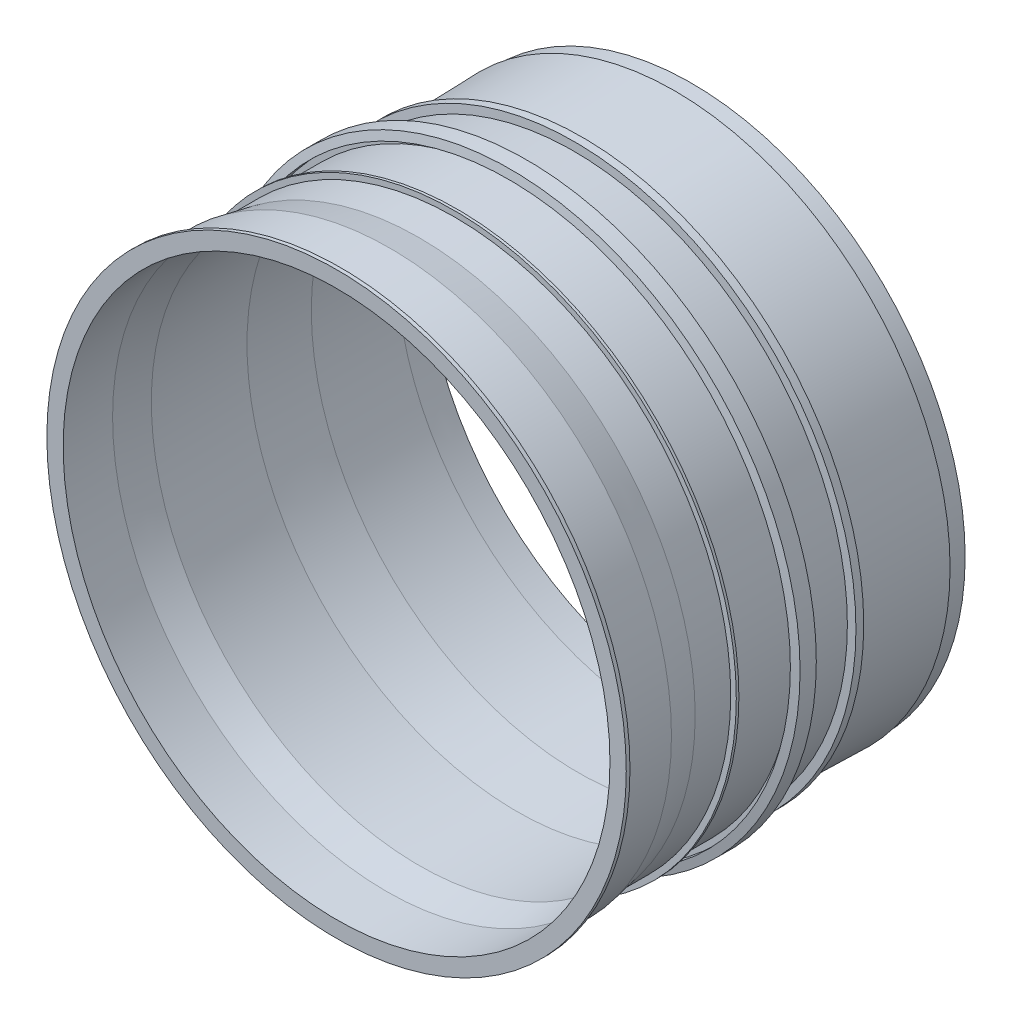
ISO-10303-21;
HEADER;
FILE_DESCRIPTION(('STEP AP214'),'2;1');
FILE_NAME('part.step','',(''),(''),'','','');
FILE_SCHEMA(('AUTOMOTIVE_DESIGN { 1 0 10303 214 1 1 1 1 }'));
ENDSEC;
DATA;
#1=APPLICATION_CONTEXT('core data for automotive mechanical design processes');
#2=APPLICATION_PROTOCOL_DEFINITION('international standard','automotive_design',2000,#1);
#3=PRODUCT_CONTEXT('',#1,'mechanical');
#4=PRODUCT('Part','Part','',(#3));
#5=PRODUCT_RELATED_PRODUCT_CATEGORY('part','',(#4));
#6=PRODUCT_DEFINITION_FORMATION('','',#4);
#7=PRODUCT_DEFINITION_CONTEXT('part definition',#1,'design');
#8=PRODUCT_DEFINITION('design','',#6,#7);
#9=PRODUCT_DEFINITION_SHAPE('','',#8);
#10=(LENGTH_UNIT() NAMED_UNIT(*) SI_UNIT(.MILLI.,.METRE.));
#11=(NAMED_UNIT(*) PLANE_ANGLE_UNIT() SI_UNIT($,.RADIAN.));
#12=(NAMED_UNIT(*) SI_UNIT($,.STERADIAN.) SOLID_ANGLE_UNIT());
#13=UNCERTAINTY_MEASURE_WITH_UNIT(LENGTH_MEASURE(1.E-05),#10,'distance_accuracy_value','');
#14=(GEOMETRIC_REPRESENTATION_CONTEXT(3) GLOBAL_UNCERTAINTY_ASSIGNED_CONTEXT((#13)) GLOBAL_UNIT_ASSIGNED_CONTEXT((#10,
#11,#12)) REPRESENTATION_CONTEXT('',''));
#15=CARTESIAN_POINT('',(0.,0.,0.));
#16=DIRECTION('',(0.,0.,1.));
#17=DIRECTION('',(1.,0.,0.));
#18=AXIS2_PLACEMENT_3D('',#15,#16,#17);
#19=CARTESIAN_POINT('',(0.,0.,-625.243112708749));
#20=DIRECTION('',(0.,0.,-1.));
#21=DIRECTION('',(-1.,0.,0.));
#22=AXIS2_PLACEMENT_3D('',#19,#20,#21);
#23=CONICAL_SURFACE('',#22,1107.27781024049,0.0123958644137673);
#24=CARTESIAN_POINT('',(0.,0.,-827.962379456543));
#25=DIRECTION('',(0.,0.,1.));
#26=DIRECTION('',(1.,0.,0.));
#27=AXIS2_PLACEMENT_3D('',#24,#25,#26);
#28=CIRCLE('',#27,1109.79081950068);
#29=CARTESIAN_POINT('',(1109.79081950068,0.,-827.962379456543));
#30=VERTEX_POINT('',#29);
#31=EDGE_CURVE('E132',#30,#30,#28,.T.);
#32=ORIENTED_EDGE('',*,*,#31,.F.);
#33=EDGE_LOOP('',(#32));
#34=FACE_BOUND('',#33,.T.);
#35=CARTESIAN_POINT('',(0.,0.,-625.243112708749));
#36=DIRECTION('',(0.,0.,1.));
#37=DIRECTION('',(1.,0.,0.));
#38=AXIS2_PLACEMENT_3D('',#35,#36,#37);
#39=CIRCLE('',#38,1107.27781024049);
#40=CARTESIAN_POINT('',(1107.27781024049,0.,-625.243112708749));
#41=VERTEX_POINT('',#40);
#42=EDGE_CURVE('E10',#41,#41,#39,.T.);
#43=ORIENTED_EDGE('',*,*,#42,.T.);
#44=EDGE_LOOP('',(#43));
#45=FACE_BOUND('',#44,.T.);
#46=ADVANCED_FACE('F35',(#34,#45),#23,.F.);
#47=CARTESIAN_POINT('',(0.,1107.27781024049,-625.243112708749));
#48=DIRECTION('',(0.,0.,-1.));
#49=DIRECTION('',(-1.,0.,0.));
#50=AXIS2_PLACEMENT_3D('',#47,#48,#49);
#51=PLANE('',#50);
#52=ORIENTED_EDGE('',*,*,#42,.F.);
#53=EDGE_LOOP('',(#52));
#54=FACE_BOUND('',#53,.T.);
#55=CARTESIAN_POINT('',(0.,0.,-625.243112708749));
#56=DIRECTION('',(0.,0.,1.));
#57=DIRECTION('',(1.,0.,0.));
#58=AXIS2_PLACEMENT_3D('',#55,#56,#57);
#59=CIRCLE('',#58,1173.29271015888);
#60=CARTESIAN_POINT('',(1173.29271015888,0.,-625.243112708749));
#61=VERTEX_POINT('',#60);
#62=EDGE_CURVE('E41',#61,#61,#59,.T.);
#63=ORIENTED_EDGE('',*,*,#62,.T.);
#64=EDGE_LOOP('',(#63));
#65=FACE_BOUND('',#64,.T.);
#66=ADVANCED_FACE('F139',(#54,#65),#51,.F.);
#67=CARTESIAN_POINT('',(0.,0.,0.));
#68=DIRECTION('',(0.,0.,1.));
#69=DIRECTION('',(1.,0.,0.));
#70=AXIS2_PLACEMENT_3D('',#67,#68,#69);
#71=CYLINDRICAL_SURFACE('',#70,1173.29271015888);
#72=ORIENTED_EDGE('',*,*,#62,.F.);
#73=EDGE_LOOP('',(#72));
#74=FACE_BOUND('',#73,.T.);
#75=CARTESIAN_POINT('',(0.,0.,-640.246499053838));
#76=DIRECTION('',(0.,0.,1.));
#77=DIRECTION('',(1.,0.,0.));
#78=AXIS2_PLACEMENT_3D('',#75,#76,#77);
#79=CIRCLE('',#78,1173.29271015888);
#80=CARTESIAN_POINT('',(1173.29271015888,0.,-640.246499053838));
#81=VERTEX_POINT('',#80);
#82=EDGE_CURVE('E45',#81,#81,#79,.T.);
#83=ORIENTED_EDGE('',*,*,#82,.T.);
#84=EDGE_LOOP('',(#83));
#85=FACE_BOUND('',#84,.T.);
#86=ADVANCED_FACE('F143',(#74,#85),#71,.T.);
#87=CARTESIAN_POINT('',(0.,1173.29271015888,-640.246499053838));
#88=DIRECTION('',(0.,0.,1.));
#89=DIRECTION('',(1.,0.,0.));
#90=AXIS2_PLACEMENT_3D('',#87,#88,#89);
#91=PLANE('',#90);
#92=ORIENTED_EDGE('',*,*,#82,.F.);
#93=EDGE_LOOP('',(#92));
#94=FACE_BOUND('',#93,.T.);
#95=CARTESIAN_POINT('',(0.,0.,-640.246499053838));
#96=DIRECTION('',(0.,0.,1.));
#97=DIRECTION('',(1.,0.,0.));
#98=AXIS2_PLACEMENT_3D('',#95,#96,#97);
#99=CIRCLE('',#98,1140.28526019969);
#100=CARTESIAN_POINT('',(1140.28526019969,0.,-640.246499053838));
#101=VERTEX_POINT('',#100);
#102=EDGE_CURVE('E49',#101,#101,#99,.T.);
#103=ORIENTED_EDGE('',*,*,#102,.T.);
#104=EDGE_LOOP('',(#103));
#105=FACE_BOUND('',#104,.T.);
#106=ADVANCED_FACE('F148',(#94,#105),#91,.F.);
#107=CARTESIAN_POINT('',(0.,0.,0.));
#108=DIRECTION('',(0.,0.,1.));
#109=DIRECTION('',(1.,0.,0.));
#110=AXIS2_PLACEMENT_3D('',#107,#108,#109);
#111=CYLINDRICAL_SURFACE('',#110,1140.28526019969);
#112=ORIENTED_EDGE('',*,*,#102,.F.);
#113=EDGE_LOOP('',(#112));
#114=FACE_BOUND('',#113,.T.);
#115=CARTESIAN_POINT('',(0.,0.,-841.291876078033));
#116=DIRECTION('',(0.,0.,1.));
#117=DIRECTION('',(1.,0.,0.));
#118=AXIS2_PLACEMENT_3D('',#115,#116,#117);
#119=CIRCLE('',#118,1140.28526019969);
#120=CARTESIAN_POINT('',(1140.28526019969,0.,-841.291876078033));
#121=VERTEX_POINT('',#120);
#122=EDGE_CURVE('E54',#121,#121,#119,.T.);
#123=ORIENTED_EDGE('',*,*,#122,.T.);
#124=EDGE_LOOP('',(#123));
#125=FACE_BOUND('',#124,.T.);
#126=ADVANCED_FACE('F154',(#114,#125),#111,.T.);
#127=CARTESIAN_POINT('',(0.,0.,-959.818628204238));
#128=DIRECTION('',(0.,0.,1.));
#129=DIRECTION('',(1.,0.,0.));
#130=AXIS2_PLACEMENT_3D('',#127,#128,#129);
#131=CONICAL_SURFACE('',#130,1117.78018068205,0.187639771804361);
#132=ORIENTED_EDGE('',*,*,#122,.F.);
#133=EDGE_LOOP('',(#132));
#134=FACE_BOUND('',#133,.T.);
#135=CARTESIAN_POINT('',(0.,0.,-959.818628204238));
#136=DIRECTION('',(0.,0.,1.));
#137=DIRECTION('',(1.,0.,0.));
#138=AXIS2_PLACEMENT_3D('',#135,#136,#137);
#139=CIRCLE('',#138,1117.78018068205);
#140=CARTESIAN_POINT('',(1117.78018068205,0.,-959.818628204238));
#141=VERTEX_POINT('',#140);
#142=EDGE_CURVE('E57',#141,#141,#139,.T.);
#143=ORIENTED_EDGE('',*,*,#142,.T.);
#144=EDGE_LOOP('',(#143));
#145=FACE_BOUND('',#144,.T.);
#146=ADVANCED_FACE('F158',(#134,#145),#131,.T.);
#147=CARTESIAN_POINT('',(0.,0.,0.));
#148=DIRECTION('',(0.,0.,1.));
#149=DIRECTION('',(1.,0.,0.));
#150=AXIS2_PLACEMENT_3D('',#147,#148,#149);
#151=CYLINDRICAL_SURFACE('',#150,1117.78018068205);
#152=ORIENTED_EDGE('',*,*,#142,.F.);
#153=EDGE_LOOP('',(#152));
#154=FACE_BOUND('',#153,.T.);
#155=CARTESIAN_POINT('',(0.,0.,-1103.85113711709));
#156=DIRECTION('',(0.,0.,1.));
#157=DIRECTION('',(1.,0.,0.));
#158=AXIS2_PLACEMENT_3D('',#155,#156,#157);
#159=CIRCLE('',#158,1117.78018068205);
#160=CARTESIAN_POINT('',(1117.78018068205,0.,-1103.85113711709));
#161=VERTEX_POINT('',#160);
#162=EDGE_CURVE('E60',#161,#161,#159,.T.);
#163=ORIENTED_EDGE('',*,*,#162,.T.);
#164=EDGE_LOOP('',(#163));
#165=FACE_BOUND('',#164,.T.);
#166=ADVANCED_FACE('F162',(#154,#165),#151,.T.);
#167=CARTESIAN_POINT('',(0.,1117.78018068205,-1103.85113711709));
#168=DIRECTION('',(0.,0.,-1.));
#169=DIRECTION('',(-1.,0.,0.));
#170=AXIS2_PLACEMENT_3D('',#167,#168,#169);
#171=PLANE('',#170);
#172=ORIENTED_EDGE('',*,*,#162,.F.);
#173=EDGE_LOOP('',(#172));
#174=FACE_BOUND('',#173,.T.);
#175=CARTESIAN_POINT('',(0.,0.,-1103.85113711709));
#176=DIRECTION('',(0.,0.,1.));
#177=DIRECTION('',(1.,0.,0.));
#178=AXIS2_PLACEMENT_3D('',#175,#176,#177);
#179=CIRCLE('',#178,1140.28526019969);
#180=CARTESIAN_POINT('',(1140.28526019969,0.,-1103.85113711709));
#181=VERTEX_POINT('',#180);
#182=EDGE_CURVE('E63',#181,#181,#179,.T.);
#183=ORIENTED_EDGE('',*,*,#182,.T.);
#184=EDGE_LOOP('',(#183));
#185=FACE_BOUND('',#184,.T.);
#186=ADVANCED_FACE('F166',(#174,#185),#171,.F.);
#187=CARTESIAN_POINT('',(0.,0.,0.));
#188=DIRECTION('',(0.,0.,1.));
#189=DIRECTION('',(1.,0.,0.));
#190=AXIS2_PLACEMENT_3D('',#187,#188,#189);
#191=CYLINDRICAL_SURFACE('',#190,1140.28526019969);
#192=ORIENTED_EDGE('',*,*,#182,.F.);
#193=EDGE_LOOP('',(#192));
#194=FACE_BOUND('',#193,.T.);
#195=CARTESIAN_POINT('',(0.,0.,-1114.35350755866));
#196=DIRECTION('',(0.,0.,1.));
#197=DIRECTION('',(1.,0.,0.));
#198=AXIS2_PLACEMENT_3D('',#195,#196,#197);
#199=CIRCLE('',#198,1140.28526019969);
#200=CARTESIAN_POINT('',(1140.28526019969,0.,-1114.35350755866));
#201=VERTEX_POINT('',#200);
#202=EDGE_CURVE('E66',#201,#201,#199,.T.);
#203=ORIENTED_EDGE('',*,*,#202,.T.);
#204=EDGE_LOOP('',(#203));
#205=FACE_BOUND('',#204,.T.);
#206=ADVANCED_FACE('F170',(#194,#205),#191,.T.);
#207=CARTESIAN_POINT('',(0.,1140.28526019969,-1114.35350755866));
#208=DIRECTION('',(0.,0.,1.));
#209=DIRECTION('',(1.,0.,0.));
#210=AXIS2_PLACEMENT_3D('',#207,#208,#209);
#211=PLANE('',#210);
#212=ORIENTED_EDGE('',*,*,#202,.F.);
#213=EDGE_LOOP('',(#212));
#214=FACE_BOUND('',#213,.T.);
#215=CARTESIAN_POINT('',(0.,0.,-1114.35350755866));
#216=DIRECTION('',(0.,0.,1.));
#217=DIRECTION('',(1.,0.,0.));
#218=AXIS2_PLACEMENT_3D('',#215,#216,#217);
#219=CIRCLE('',#218,1117.78018068205);
#220=CARTESIAN_POINT('',(1117.78018068205,0.,-1114.35350755866));
#221=VERTEX_POINT('',#220);
#222=EDGE_CURVE('E69',#221,#221,#219,.T.);
#223=ORIENTED_EDGE('',*,*,#222,.T.);
#224=EDGE_LOOP('',(#223));
#225=FACE_BOUND('',#224,.T.);
#226=ADVANCED_FACE('F174',(#214,#225),#211,.F.);
#227=CARTESIAN_POINT('',(0.,0.,0.));
#228=DIRECTION('',(0.,0.,1.));
#229=DIRECTION('',(1.,0.,0.));
#230=AXIS2_PLACEMENT_3D('',#227,#228,#229);
#231=CYLINDRICAL_SURFACE('',#230,1117.78018068205);
#232=ORIENTED_EDGE('',*,*,#222,.F.);
#233=EDGE_LOOP('',(#232));
#234=FACE_BOUND('',#233,.T.);
#235=CARTESIAN_POINT('',(0.,0.,-1355.90802771459));
#236=DIRECTION('',(0.,0.,1.));
#237=DIRECTION('',(1.,0.,0.));
#238=AXIS2_PLACEMENT_3D('',#235,#236,#237);
#239=CIRCLE('',#238,1117.78018068205);
#240=CARTESIAN_POINT('',(1117.78018068205,0.,-1355.90802771459));
#241=VERTEX_POINT('',#240);
#242=EDGE_CURVE('E72',#241,#241,#239,.T.);
#243=ORIENTED_EDGE('',*,*,#242,.T.);
#244=EDGE_LOOP('',(#243));
#245=FACE_BOUND('',#244,.T.);
#246=ADVANCED_FACE('F178',(#234,#245),#231,.T.);
#247=CARTESIAN_POINT('',(0.,1117.78018068205,-1355.90802771459));
#248=DIRECTION('',(0.,0.,-1.));
#249=DIRECTION('',(-1.,0.,0.));
#250=AXIS2_PLACEMENT_3D('',#247,#248,#249);
#251=PLANE('',#250);
#252=ORIENTED_EDGE('',*,*,#242,.F.);
#253=EDGE_LOOP('',(#252));
#254=FACE_BOUND('',#253,.T.);
#255=CARTESIAN_POINT('',(0.,0.,-1355.90802771459));
#256=DIRECTION('',(0.,0.,1.));
#257=DIRECTION('',(1.,0.,0.));
#258=AXIS2_PLACEMENT_3D('',#255,#256,#257);
#259=CIRCLE('',#258,1140.28526019969);
#260=CARTESIAN_POINT('',(1140.28526019969,0.,-1355.90802771459));
#261=VERTEX_POINT('',#260);
#262=EDGE_CURVE('E75',#261,#261,#259,.T.);
#263=ORIENTED_EDGE('',*,*,#262,.T.);
#264=EDGE_LOOP('',(#263));
#265=FACE_BOUND('',#264,.T.);
#266=ADVANCED_FACE('F182',(#254,#265),#251,.F.);
#267=CARTESIAN_POINT('',(0.,0.,0.));
#268=DIRECTION('',(0.,0.,1.));
#269=DIRECTION('',(1.,0.,0.));
#270=AXIS2_PLACEMENT_3D('',#267,#268,#269);
#271=CYLINDRICAL_SURFACE('',#270,1140.28526019969);
#272=ORIENTED_EDGE('',*,*,#262,.F.);
#273=EDGE_LOOP('',(#272));
#274=FACE_BOUND('',#273,.T.);
#275=CARTESIAN_POINT('',(0.,0.,-1322.9005777554));
#276=DIRECTION('',(0.,0.,1.));
#277=DIRECTION('',(1.,0.,0.));
#278=AXIS2_PLACEMENT_3D('',#275,#276,#277);
#279=CIRCLE('',#278,1140.28526019969);
#280=CARTESIAN_POINT('',(1140.28526019969,0.,-1322.9005777554));
#281=VERTEX_POINT('',#280);
#282=EDGE_CURVE('E78',#281,#281,#279,.T.);
#283=ORIENTED_EDGE('',*,*,#282,.T.);
#284=EDGE_LOOP('',(#283));
#285=FACE_BOUND('',#284,.T.);
#286=ADVANCED_FACE('F186',(#274,#285),#271,.F.);
#287=CARTESIAN_POINT('',(0.,0.,-1329.16781508942));
#288=DIRECTION('',(0.,0.,-1.));
#289=DIRECTION('',(-1.,0.,0.));
#290=AXIS2_PLACEMENT_3D('',#287,#288,#289);
#291=CONICAL_SURFACE('',#290,1173.29271015888,1.38315655499054);
#292=ORIENTED_EDGE('',*,*,#282,.F.);
#293=EDGE_LOOP('',(#292));
#294=FACE_BOUND('',#293,.T.);
#295=CARTESIAN_POINT('',(0.,0.,-1329.16781508942));
#296=DIRECTION('',(0.,0.,1.));
#297=DIRECTION('',(1.,0.,0.));
#298=AXIS2_PLACEMENT_3D('',#295,#296,#297);
#299=CIRCLE('',#298,1173.29271015888);
#300=CARTESIAN_POINT('',(1173.29271015888,0.,-1329.16781508942));
#301=VERTEX_POINT('',#300);
#302=EDGE_CURVE('E81',#301,#301,#299,.T.);
#303=ORIENTED_EDGE('',*,*,#302,.T.);
#304=EDGE_LOOP('',(#303));
#305=FACE_BOUND('',#304,.T.);
#306=ADVANCED_FACE('F190',(#294,#305),#291,.T.);
#307=CARTESIAN_POINT('',(0.,0.,0.));
#308=DIRECTION('',(0.,0.,1.));
#309=DIRECTION('',(1.,0.,0.));
#310=AXIS2_PLACEMENT_3D('',#307,#308,#309);
#311=CYLINDRICAL_SURFACE('',#310,1173.29271015888);
#312=ORIENTED_EDGE('',*,*,#302,.F.);
#313=EDGE_LOOP('',(#312));
#314=FACE_BOUND('',#313,.T.);
#315=CARTESIAN_POINT('',(0.,0.,-1394.91683221182));
#316=DIRECTION('',(0.,0.,1.));
#317=DIRECTION('',(1.,0.,0.));
#318=AXIS2_PLACEMENT_3D('',#315,#316,#317);
#319=CIRCLE('',#318,1173.29271015888);
#320=CARTESIAN_POINT('',(1173.29271015888,0.,-1394.91683221182));
#321=VERTEX_POINT('',#320);
#322=EDGE_CURVE('E84',#321,#321,#319,.T.);
#323=ORIENTED_EDGE('',*,*,#322,.T.);
#324=EDGE_LOOP('',(#323));
#325=FACE_BOUND('',#324,.T.);
#326=ADVANCED_FACE('F194',(#314,#325),#311,.T.);
#327=CARTESIAN_POINT('',(0.,0.,-1412.95381464829));
#328=DIRECTION('',(0.,0.,1.));
#329=DIRECTION('',(1.,0.,0.));
#330=AXIS2_PLACEMENT_3D('',#327,#328,#329);
#331=CONICAL_SURFACE('',#330,1140.28526019969,1.07068129613697);
#332=ORIENTED_EDGE('',*,*,#322,.F.);
#333=EDGE_LOOP('',(#332));
#334=FACE_BOUND('',#333,.T.);
#335=CARTESIAN_POINT('',(0.,0.,-1412.95381464829));
#336=DIRECTION('',(0.,0.,1.));
#337=DIRECTION('',(1.,0.,0.));
#338=AXIS2_PLACEMENT_3D('',#335,#336,#337);
#339=CIRCLE('',#338,1140.28526019969);
#340=CARTESIAN_POINT('',(1140.28526019969,0.,-1412.95381464829));
#341=VERTEX_POINT('',#340);
#342=EDGE_CURVE('E87',#341,#341,#339,.T.);
#343=ORIENTED_EDGE('',*,*,#342,.T.);
#344=EDGE_LOOP('',(#343));
#345=FACE_BOUND('',#344,.T.);
#346=ADVANCED_FACE('F198',(#334,#345),#331,.T.);
#347=CARTESIAN_POINT('',(0.,0.,0.));
#348=DIRECTION('',(0.,0.,1.));
#349=DIRECTION('',(1.,0.,0.));
#350=AXIS2_PLACEMENT_3D('',#347,#348,#349);
#351=CYLINDRICAL_SURFACE('',#350,1140.28526019969);
#352=ORIENTED_EDGE('',*,*,#342,.F.);
#353=EDGE_LOOP('',(#352));
#354=FACE_BOUND('',#353,.T.);
#355=CARTESIAN_POINT('',(0.,0.,-1373.73371524404));
#356=DIRECTION('',(0.,0.,1.));
#357=DIRECTION('',(1.,0.,0.));
#358=AXIS2_PLACEMENT_3D('',#355,#356,#357);
#359=CIRCLE('',#358,1140.28526019969);
#360=CARTESIAN_POINT('',(1140.28526019969,0.,-1373.73371524404));
#361=VERTEX_POINT('',#360);
#362=EDGE_CURVE('E90',#361,#361,#359,.T.);
#363=ORIENTED_EDGE('',*,*,#362,.T.);
#364=EDGE_LOOP('',(#363));
#365=FACE_BOUND('',#364,.T.);
#366=ADVANCED_FACE('F202',(#354,#365),#351,.F.);
#367=CARTESIAN_POINT('',(0.,1140.28526019969,-1373.73371524404));
#368=DIRECTION('',(0.,0.,1.));
#369=DIRECTION('',(1.,0.,0.));
#370=AXIS2_PLACEMENT_3D('',#367,#368,#369);
#371=PLANE('',#370);
#372=ORIENTED_EDGE('',*,*,#362,.F.);
#373=EDGE_LOOP('',(#372));
#374=FACE_BOUND('',#373,.T.);
#375=CARTESIAN_POINT('',(0.,0.,-1373.73371524404));
#376=DIRECTION('',(0.,0.,1.));
#377=DIRECTION('',(1.,0.,0.));
#378=AXIS2_PLACEMENT_3D('',#375,#376,#377);
#379=CIRCLE('',#378,1117.78018068205);
#380=CARTESIAN_POINT('',(1117.78018068205,0.,-1373.73371524404));
#381=VERTEX_POINT('',#380);
#382=EDGE_CURVE('E93',#381,#381,#379,.T.);
#383=ORIENTED_EDGE('',*,*,#382,.T.);
#384=EDGE_LOOP('',(#383));
#385=FACE_BOUND('',#384,.T.);
#386=ADVANCED_FACE('F206',(#374,#385),#371,.F.);
#387=CARTESIAN_POINT('',(0.,0.,-1586.79305110007));
#388=DIRECTION('',(0.,0.,1.));
#389=DIRECTION('',(1.,0.,0.));
#390=AXIS2_PLACEMENT_3D('',#387,#388,#389);
#391=CONICAL_SURFACE('',#390,1107.27781024049,0.0492533054253626);
#392=ORIENTED_EDGE('',*,*,#382,.F.);
#393=EDGE_LOOP('',(#392));
#394=FACE_BOUND('',#393,.T.);
#395=CARTESIAN_POINT('',(0.,0.,-1586.79305110007));
#396=DIRECTION('',(0.,0.,1.));
#397=DIRECTION('',(1.,0.,0.));
#398=AXIS2_PLACEMENT_3D('',#395,#396,#397);
#399=CIRCLE('',#398,1107.27781024049);
#400=CARTESIAN_POINT('',(1107.27781024049,0.,-1586.79305110007));
#401=VERTEX_POINT('',#400);
#402=EDGE_CURVE('E96',#401,#401,#399,.T.);
#403=ORIENTED_EDGE('',*,*,#402,.T.);
#404=EDGE_LOOP('',(#403));
#405=FACE_BOUND('',#404,.T.);
#406=ADVANCED_FACE('F210',(#394,#405),#391,.T.);
#407=CARTESIAN_POINT('',(0.,0.,-1588.4200930009));
#408=DIRECTION('',(0.,0.,-1.));
#409=DIRECTION('',(-1.,0.,0.));
#410=AXIS2_PLACEMENT_3D('',#407,#408,#409);
#411=CONICAL_SURFACE('',#410,1140.28526019969,1.52154302136954);
#412=ORIENTED_EDGE('',*,*,#402,.F.);
#413=EDGE_LOOP('',(#412));
#414=FACE_BOUND('',#413,.T.);
#415=CARTESIAN_POINT('',(0.,0.,-1588.4200930009));
#416=DIRECTION('',(0.,0.,1.));
#417=DIRECTION('',(1.,0.,0.));
#418=AXIS2_PLACEMENT_3D('',#415,#416,#417);
#419=CIRCLE('',#418,1140.28526019969);
#420=CARTESIAN_POINT('',(1140.28526019969,0.,-1588.4200930009));
#421=VERTEX_POINT('',#420);
#422=EDGE_CURVE('E99',#421,#421,#419,.T.);
#423=ORIENTED_EDGE('',*,*,#422,.T.);
#424=EDGE_LOOP('',(#423));
#425=FACE_BOUND('',#424,.T.);
#426=ADVANCED_FACE('F214',(#414,#425),#411,.T.);
#427=CARTESIAN_POINT('',(0.,0.,0.));
#428=DIRECTION('',(0.,0.,1.));
#429=DIRECTION('',(1.,0.,0.));
#430=AXIS2_PLACEMENT_3D('',#427,#428,#429);
#431=CYLINDRICAL_SURFACE('',#430,1140.28526019969);
#432=ORIENTED_EDGE('',*,*,#422,.F.);
#433=EDGE_LOOP('',(#432));
#434=FACE_BOUND('',#433,.T.);
#435=CARTESIAN_POINT('',(0.,0.,-1619.96762738816));
#436=DIRECTION('',(0.,0.,1.));
#437=DIRECTION('',(1.,0.,0.));
#438=AXIS2_PLACEMENT_3D('',#435,#436,#437);
#439=CIRCLE('',#438,1140.28526019969);
#440=CARTESIAN_POINT('',(1140.28526019969,0.,-1619.96762738816));
#441=VERTEX_POINT('',#440);
#442=EDGE_CURVE('E102',#441,#441,#439,.T.);
#443=ORIENTED_EDGE('',*,*,#442,.T.);
#444=EDGE_LOOP('',(#443));
#445=FACE_BOUND('',#444,.T.);
#446=ADVANCED_FACE('F218',(#434,#445),#431,.T.);
#447=CARTESIAN_POINT('',(0.,1123.78153522009,-1619.96762738816));
#448=DIRECTION('',(0.,0.,1.));
#449=DIRECTION('',(1.,0.,0.));
#450=AXIS2_PLACEMENT_3D('',#447,#448,#449);
#451=PLANE('',#450);
#452=ORIENTED_EDGE('',*,*,#442,.F.);
#453=EDGE_LOOP('',(#452));
#454=FACE_BOUND('',#453,.T.);
#455=CARTESIAN_POINT('',(0.,0.,-1619.96762738816));
#456=DIRECTION('',(0.,0.,1.));
#457=DIRECTION('',(1.,0.,0.));
#458=AXIS2_PLACEMENT_3D('',#455,#456,#457);
#459=CIRCLE('',#458,1107.27781024049);
#460=CARTESIAN_POINT('',(1107.27781024049,0.,-1619.96762738816));
#461=VERTEX_POINT('',#460);
#462=EDGE_CURVE('E105',#461,#461,#459,.T.);
#463=ORIENTED_EDGE('',*,*,#462,.T.);
#464=EDGE_LOOP('',(#463));
#465=FACE_BOUND('',#464,.T.);
#466=ADVANCED_FACE('F222',(#454,#465),#451,.F.);
#467=CARTESIAN_POINT('',(0.,0.,-1994.47135603961));
#468=DIRECTION('',(0.,0.,-1.));
#469=DIRECTION('',(-1.,0.,0.));
#470=AXIS2_PLACEMENT_3D('',#467,#468,#469);
#471=CONICAL_SURFACE('',#470,1115.52967273029,0.0220305615500204);
#472=ORIENTED_EDGE('',*,*,#462,.F.);
#473=EDGE_LOOP('',(#472));
#474=FACE_BOUND('',#473,.T.);
#475=CARTESIAN_POINT('',(0.,0.,-1994.47135603961));
#476=DIRECTION('',(0.,0.,1.));
#477=DIRECTION('',(1.,0.,0.));
#478=AXIS2_PLACEMENT_3D('',#475,#476,#477);
#479=CIRCLE('',#478,1115.52967273029);
#480=CARTESIAN_POINT('',(1115.52967273029,0.,-1994.47135603961));
#481=VERTEX_POINT('',#480);
#482=EDGE_CURVE('E108',#481,#481,#479,.T.);
#483=ORIENTED_EDGE('',*,*,#482,.T.);
#484=EDGE_LOOP('',(#483));
#485=FACE_BOUND('',#484,.T.);
#486=ADVANCED_FACE('F226',(#474,#485),#471,.T.);
#487=CARTESIAN_POINT('',(0.,1115.52967273029,-1994.47135603961));
#488=DIRECTION('',(0.,0.,1.));
#489=DIRECTION('',(1.,0.,0.));
#490=AXIS2_PLACEMENT_3D('',#487,#488,#489);
#491=PLANE('',#490);
#492=ORIENTED_EDGE('',*,*,#482,.F.);
#493=EDGE_LOOP('',(#492));
#494=FACE_BOUND('',#493,.T.);
#495=CARTESIAN_POINT('',(0.,0.,-1994.47135603961));
#496=DIRECTION('',(0.,0.,1.));
#497=DIRECTION('',(1.,0.,0.));
#498=AXIS2_PLACEMENT_3D('',#495,#496,#497);
#499=CIRCLE('',#498,1107.27781024049);
#500=CARTESIAN_POINT('',(1107.27781024049,0.,-1994.47135603961));
#501=VERTEX_POINT('',#500);
#502=EDGE_CURVE('E111',#501,#501,#499,.T.);
#503=ORIENTED_EDGE('',*,*,#502,.T.);
#504=EDGE_LOOP('',(#503));
#505=FACE_BOUND('',#504,.T.);
#506=ADVANCED_FACE('F230',(#494,#505),#491,.F.);
#507=CARTESIAN_POINT('',(0.,0.,0.));
#508=DIRECTION('',(0.,0.,1.));
#509=DIRECTION('',(1.,0.,0.));
#510=AXIS2_PLACEMENT_3D('',#507,#508,#509);
#511=CYLINDRICAL_SURFACE('',#510,1107.27781024049);
#512=ORIENTED_EDGE('',*,*,#502,.F.);
#513=EDGE_LOOP('',(#512));
#514=FACE_BOUND('',#513,.T.);
#515=CARTESIAN_POINT('',(0.,0.,-2063.69823877829));
#516=DIRECTION('',(0.,0.,1.));
#517=DIRECTION('',(1.,0.,0.));
#518=AXIS2_PLACEMENT_3D('',#515,#516,#517);
#519=CIRCLE('',#518,1107.27781024049);
#520=CARTESIAN_POINT('',(1107.27781024049,0.,-2063.69823877829));
#521=VERTEX_POINT('',#520);
#522=EDGE_CURVE('E114',#521,#521,#519,.T.);
#523=ORIENTED_EDGE('',*,*,#522,.T.);
#524=EDGE_LOOP('',(#523));
#525=FACE_BOUND('',#524,.T.);
#526=ADVANCED_FACE('F234',(#514,#525),#511,.T.);
#527=CARTESIAN_POINT('',(0.,1107.27781024049,-2063.69823877829));
#528=DIRECTION('',(0.,0.,1.));
#529=DIRECTION('',(1.,0.,0.));
#530=AXIS2_PLACEMENT_3D('',#527,#528,#529);
#531=PLANE('',#530);
#532=ORIENTED_EDGE('',*,*,#522,.F.);
#533=EDGE_LOOP('',(#532));
#534=FACE_BOUND('',#533,.T.);
#535=CARTESIAN_POINT('',(0.,0.,-2063.69823877829));
#536=DIRECTION('',(0.,0.,1.));
#537=DIRECTION('',(1.,0.,0.));
#538=AXIS2_PLACEMENT_3D('',#535,#536,#537);
#539=CIRCLE('',#538,1083.76964090177);
#540=CARTESIAN_POINT('',(1083.76964090177,0.,-2063.69823877829));
#541=VERTEX_POINT('',#540);
#542=EDGE_CURVE('E117',#541,#541,#539,.T.);
#543=ORIENTED_EDGE('',*,*,#542,.T.);
#544=EDGE_LOOP('',(#543));
#545=FACE_BOUND('',#544,.T.);
#546=ADVANCED_FACE('F238',(#534,#545),#531,.F.);
#547=CARTESIAN_POINT('',(0.,0.,-1949.0519734596));
#548=DIRECTION('',(0.,0.,-1.));
#549=DIRECTION('',(-1.,0.,0.));
#550=AXIS2_PLACEMENT_3D('',#547,#548,#549);
#551=CONICAL_SURFACE('',#550,1081.24351060185,0.0220305615500195);
#552=ORIENTED_EDGE('',*,*,#542,.F.);
#553=EDGE_LOOP('',(#552));
#554=FACE_BOUND('',#553,.T.);
#555=CARTESIAN_POINT('',(0.,0.,-1949.0519734596));
#556=DIRECTION('',(0.,0.,1.));
#557=DIRECTION('',(1.,0.,0.));
#558=AXIS2_PLACEMENT_3D('',#555,#556,#557);
#559=CIRCLE('',#558,1081.24351060185);
#560=CARTESIAN_POINT('',(1081.24351060185,0.,-1949.0519734596));
#561=VERTEX_POINT('',#560);
#562=EDGE_CURVE('E120',#561,#561,#559,.T.);
#563=ORIENTED_EDGE('',*,*,#562,.T.);
#564=EDGE_LOOP('',(#563));
#565=FACE_BOUND('',#564,.T.);
#566=ADVANCED_FACE('F242',(#554,#565),#551,.F.);
#567=CARTESIAN_POINT('',(0.,0.,0.));
#568=DIRECTION('',(0.,0.,1.));
#569=DIRECTION('',(1.,0.,0.));
#570=AXIS2_PLACEMENT_3D('',#567,#568,#569);
#571=CYLINDRICAL_SURFACE('',#570,1081.24351060185);
#572=ORIENTED_EDGE('',*,*,#562,.F.);
#573=EDGE_LOOP('',(#572));
#574=FACE_BOUND('',#573,.T.);
#575=CARTESIAN_POINT('',(0.,0.,-1604.19386019453));
#576=DIRECTION('',(0.,0.,1.));
#577=DIRECTION('',(1.,0.,0.));
#578=AXIS2_PLACEMENT_3D('',#575,#576,#577);
#579=CIRCLE('',#578,1081.24351060185);
#580=CARTESIAN_POINT('',(1081.24351060185,0.,-1604.19386019453));
#581=VERTEX_POINT('',#580);
#582=EDGE_CURVE('E123',#581,#581,#579,.T.);
#583=ORIENTED_EDGE('',*,*,#582,.T.);
#584=EDGE_LOOP('',(#583));
#585=FACE_BOUND('',#584,.T.);
#586=ADVANCED_FACE('F246',(#574,#585),#571,.F.);
#587=CARTESIAN_POINT('',(0.,0.,-1355.90802771459));
#588=DIRECTION('',(0.,0.,1.));
#589=DIRECTION('',(1.,0.,0.));
#590=AXIS2_PLACEMENT_3D('',#587,#588,#589);
#591=CONICAL_SURFACE('',#590,1093.48230679268,0.0492533054253622);
#592=ORIENTED_EDGE('',*,*,#582,.F.);
#593=EDGE_LOOP('',(#592));
#594=FACE_BOUND('',#593,.T.);
#595=CARTESIAN_POINT('',(0.,0.,-1355.90802771459));
#596=DIRECTION('',(0.,0.,1.));
#597=DIRECTION('',(1.,0.,0.));
#598=AXIS2_PLACEMENT_3D('',#595,#596,#597);
#599=CIRCLE('',#598,1093.48230679268);
#600=CARTESIAN_POINT('',(1093.48230679268,0.,-1355.90802771459));
#601=VERTEX_POINT('',#600);
#602=EDGE_CURVE('E126',#601,#601,#599,.T.);
#603=ORIENTED_EDGE('',*,*,#602,.T.);
#604=EDGE_LOOP('',(#603));
#605=FACE_BOUND('',#604,.T.);
#606=ADVANCED_FACE('F250',(#594,#605),#591,.F.);
#607=CARTESIAN_POINT('',(0.,0.,-959.818628204238));
#608=DIRECTION('',(0.,0.,-1.));
#609=DIRECTION('',(-1.,0.,0.));
#610=AXIS2_PLACEMENT_3D('',#607,#608,#609);
#611=CONICAL_SURFACE('',#610,1084.75482290301,0.0220305615500204);
#612=ORIENTED_EDGE('',*,*,#602,.F.);
#613=EDGE_LOOP('',(#612));
#614=FACE_BOUND('',#613,.T.);
#615=CARTESIAN_POINT('',(0.,0.,-959.818628204238));
#616=DIRECTION('',(0.,0.,1.));
#617=DIRECTION('',(1.,0.,0.));
#618=AXIS2_PLACEMENT_3D('',#615,#616,#617);
#619=CIRCLE('',#618,1084.75482290301);
#620=CARTESIAN_POINT('',(1084.75482290301,0.,-959.818628204238));
#621=VERTEX_POINT('',#620);
#622=EDGE_CURVE('E129',#621,#621,#619,.T.);
#623=ORIENTED_EDGE('',*,*,#622,.T.);
#624=EDGE_LOOP('',(#623));
#625=FACE_BOUND('',#624,.T.);
#626=ADVANCED_FACE('F254',(#614,#625),#611,.F.);
#627=CARTESIAN_POINT('',(0.,0.,-827.962379456543));
#628=DIRECTION('',(0.,0.,1.));
#629=DIRECTION('',(1.,0.,0.));
#630=AXIS2_PLACEMENT_3D('',#627,#628,#629);
#631=CONICAL_SURFACE('',#630,1109.79081950068,0.187639771804361);
#632=ORIENTED_EDGE('',*,*,#622,.F.);
#633=EDGE_LOOP('',(#632));
#634=FACE_BOUND('',#633,.T.);
#635=ORIENTED_EDGE('',*,*,#31,.T.);
#636=EDGE_LOOP('',(#635));
#637=FACE_BOUND('',#636,.T.);
#638=ADVANCED_FACE('F136',(#634,#637),#631,.F.);
#639=CLOSED_SHELL('',(#46,#66,#86,#106,#126,#146,#166,#186,#206,#226,#246,#266,#286,#306,#326,
#346,#366,#386,#406,#426,#446,#466,#486,#506,#526,#546,#566,#586,#606,#626,#638));
#640=MANIFOLD_SOLID_BREP('B2',#639);
#641=ADVANCED_BREP_SHAPE_REPRESENTATION('',(#18,#640),#14);
#642=SHAPE_DEFINITION_REPRESENTATION(#9,#641);
ENDSEC;
END-ISO-10303-21;
